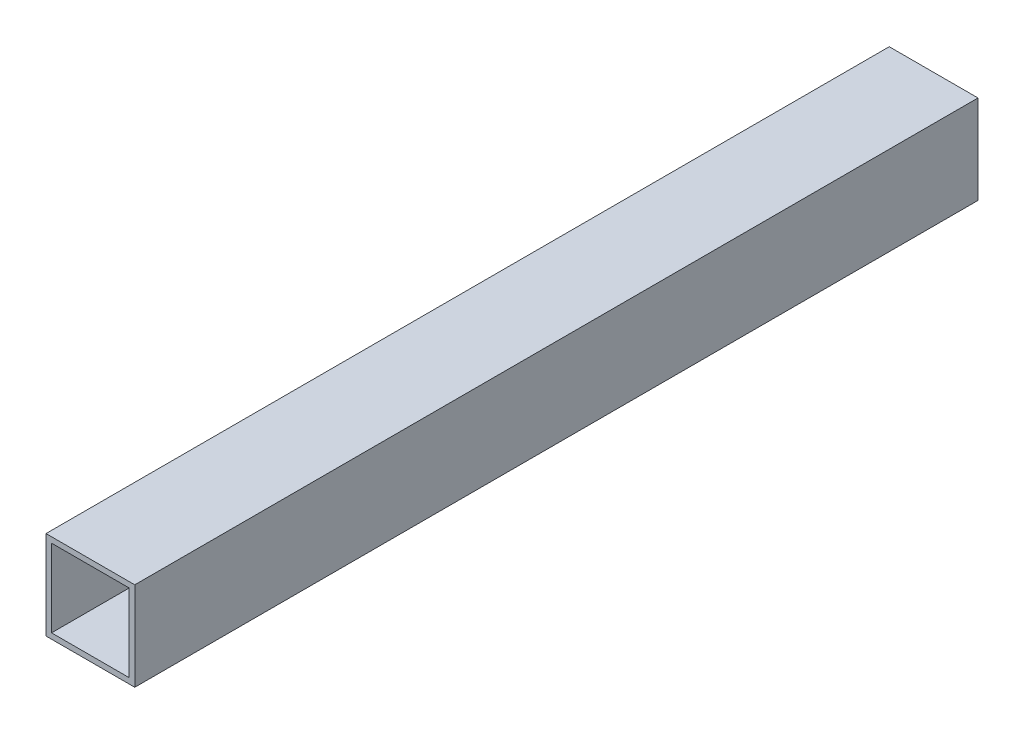
ISO-10303-21;
HEADER;
FILE_DESCRIPTION(('STEP AP214'),'2;1');
FILE_NAME('part.step','',(''),(''),'','','');
FILE_SCHEMA(('AUTOMOTIVE_DESIGN { 1 0 10303 214 1 1 1 1 }'));
ENDSEC;
DATA;
#1=APPLICATION_CONTEXT('core data for automotive mechanical design processes');
#2=APPLICATION_PROTOCOL_DEFINITION('international standard','automotive_design',2000,#1);
#3=PRODUCT_CONTEXT('',#1,'mechanical');
#4=PRODUCT('Part','Part','',(#3));
#5=PRODUCT_RELATED_PRODUCT_CATEGORY('part','',(#4));
#6=PRODUCT_DEFINITION_FORMATION('','',#4);
#7=PRODUCT_DEFINITION_CONTEXT('part definition',#1,'design');
#8=PRODUCT_DEFINITION('design','',#6,#7);
#9=PRODUCT_DEFINITION_SHAPE('','',#8);
#10=(LENGTH_UNIT() NAMED_UNIT(*) SI_UNIT(.MILLI.,.METRE.));
#11=(NAMED_UNIT(*) PLANE_ANGLE_UNIT() SI_UNIT($,.RADIAN.));
#12=(NAMED_UNIT(*) SI_UNIT($,.STERADIAN.) SOLID_ANGLE_UNIT());
#13=UNCERTAINTY_MEASURE_WITH_UNIT(LENGTH_MEASURE(1.E-05),#10,'distance_accuracy_value','');
#14=(GEOMETRIC_REPRESENTATION_CONTEXT(3) GLOBAL_UNCERTAINTY_ASSIGNED_CONTEXT((#13)) GLOBAL_UNIT_ASSIGNED_CONTEXT((#10,
#11,#12)) REPRESENTATION_CONTEXT('',''));
#15=CARTESIAN_POINT('',(0.,0.,0.));
#16=DIRECTION('',(0.,0.,1.));
#17=DIRECTION('',(1.,0.,0.));
#18=AXIS2_PLACEMENT_3D('',#15,#16,#17);
#19=CARTESIAN_POINT('',(0.,0.,482.6));
#20=DIRECTION('',(0.,0.,-1.));
#21=DIRECTION('',(-1.,0.,0.));
#22=AXIS2_PLACEMENT_3D('',#19,#20,#21);
#23=PLANE('',#22);
#24=DIRECTION('',(0.,-1.,0.));
#25=VECTOR('',#24,1.);
#26=CARTESIAN_POINT('',(0.,0.,482.6));
#27=LINE('',#26,#25);
#28=CARTESIAN_POINT('',(0.,50.8,482.6));
#29=VERTEX_POINT('',#28);
#30=CARTESIAN_POINT('',(0.,0.,482.6));
#31=VERTEX_POINT('',#30);
#32=EDGE_CURVE('E134',#29,#31,#27,.T.);
#33=ORIENTED_EDGE('',*,*,#32,.T.);
#34=DIRECTION('',(1.,0.,0.));
#35=VECTOR('',#34,1.);
#36=CARTESIAN_POINT('',(0.,0.,482.6));
#37=LINE('',#36,#35);
#38=CARTESIAN_POINT('',(50.8,0.,482.6));
#39=VERTEX_POINT('',#38);
#40=EDGE_CURVE('E137',#31,#39,#37,.T.);
#41=ORIENTED_EDGE('',*,*,#40,.T.);
#42=DIRECTION('',(0.,1.,0.));
#43=VECTOR('',#42,1.);
#44=CARTESIAN_POINT('',(50.8,0.,482.6));
#45=LINE('',#44,#43);
#46=CARTESIAN_POINT('',(50.8,50.8,482.6));
#47=VERTEX_POINT('',#46);
#48=EDGE_CURVE('E140',#39,#47,#45,.T.);
#49=ORIENTED_EDGE('',*,*,#48,.T.);
#50=DIRECTION('',(-1.,0.,0.));
#51=VECTOR('',#50,1.);
#52=CARTESIAN_POINT('',(0.,50.8,482.6));
#53=LINE('',#52,#51);
#54=EDGE_CURVE('E142',#47,#29,#53,.T.);
#55=ORIENTED_EDGE('',*,*,#54,.T.);
#56=EDGE_LOOP('',(#33,#41,#49,#55));
#57=FACE_BOUND('',#56,.T.);
#58=DIRECTION('',(0.,-1.,0.));
#59=VECTOR('',#58,1.);
#60=CARTESIAN_POINT('',(3.175,47.625,482.6));
#61=LINE('',#60,#59);
#62=CARTESIAN_POINT('',(3.175,47.625,482.6));
#63=VERTEX_POINT('',#62);
#64=CARTESIAN_POINT('',(3.17500000000001,3.175,482.6));
#65=VERTEX_POINT('',#64);
#66=EDGE_CURVE('E98',#63,#65,#61,.T.);
#67=ORIENTED_EDGE('',*,*,#66,.F.);
#68=DIRECTION('',(-1.,0.,0.));
#69=VECTOR('',#68,1.);
#70=CARTESIAN_POINT('',(3.175,47.625,482.6));
#71=LINE('',#70,#69);
#72=CARTESIAN_POINT('',(47.625,47.625,482.6));
#73=VERTEX_POINT('',#72);
#74=EDGE_CURVE('E120',#73,#63,#71,.T.);
#75=ORIENTED_EDGE('',*,*,#74,.F.);
#76=DIRECTION('',(0.,1.,0.));
#77=VECTOR('',#76,1.);
#78=CARTESIAN_POINT('',(47.625,47.625,482.6));
#79=LINE('',#78,#77);
#80=CARTESIAN_POINT('',(47.625,3.175,482.6));
#81=VERTEX_POINT('',#80);
#82=EDGE_CURVE('E118',#81,#73,#79,.T.);
#83=ORIENTED_EDGE('',*,*,#82,.F.);
#84=DIRECTION('',(1.,0.,0.));
#85=VECTOR('',#84,1.);
#86=CARTESIAN_POINT('',(3.17500000000001,3.175,482.6));
#87=LINE('',#86,#85);
#88=EDGE_CURVE('E106',#65,#81,#87,.T.);
#89=ORIENTED_EDGE('',*,*,#88,.F.);
#90=EDGE_LOOP('',(#67,#75,#83,#89));
#91=FACE_BOUND('',#90,.T.);
#92=ADVANCED_FACE('F33',(#57,#91),#23,.F.);
#93=CARTESIAN_POINT('',(0.,0.,0.));
#94=DIRECTION('',(0.,0.,-1.));
#95=DIRECTION('',(-1.,0.,0.));
#96=AXIS2_PLACEMENT_3D('',#93,#94,#95);
#97=PLANE('',#96);
#98=DIRECTION('',(0.,-1.,0.));
#99=VECTOR('',#98,1.);
#100=CARTESIAN_POINT('',(0.,0.,0.));
#101=LINE('',#100,#99);
#102=CARTESIAN_POINT('',(0.,50.8,0.));
#103=VERTEX_POINT('',#102);
#104=CARTESIAN_POINT('',(0.,0.,0.));
#105=VERTEX_POINT('',#104);
#106=EDGE_CURVE('E114',#103,#105,#101,.T.);
#107=ORIENTED_EDGE('',*,*,#106,.F.);
#108=DIRECTION('',(-1.,0.,0.));
#109=VECTOR('',#108,1.);
#110=CARTESIAN_POINT('',(0.,50.8,0.));
#111=LINE('',#110,#109);
#112=CARTESIAN_POINT('',(50.8,50.8,0.));
#113=VERTEX_POINT('',#112);
#114=EDGE_CURVE('E138',#113,#103,#111,.T.);
#115=ORIENTED_EDGE('',*,*,#114,.F.);
#116=DIRECTION('',(0.,1.,0.));
#117=VECTOR('',#116,1.);
#118=CARTESIAN_POINT('',(50.8,0.,0.));
#119=LINE('',#118,#117);
#120=CARTESIAN_POINT('',(50.8,0.,0.));
#121=VERTEX_POINT('',#120);
#122=EDGE_CURVE('E149',#121,#113,#119,.T.);
#123=ORIENTED_EDGE('',*,*,#122,.F.);
#124=DIRECTION('',(1.,0.,0.));
#125=VECTOR('',#124,1.);
#126=CARTESIAN_POINT('',(0.,0.,0.));
#127=LINE('',#126,#125);
#128=EDGE_CURVE('E147',#105,#121,#127,.T.);
#129=ORIENTED_EDGE('',*,*,#128,.F.);
#130=EDGE_LOOP('',(#107,#115,#123,#129));
#131=FACE_BOUND('',#130,.T.);
#132=DIRECTION('',(-1.,0.,0.));
#133=VECTOR('',#132,1.);
#134=CARTESIAN_POINT('',(3.175,47.625,0.));
#135=LINE('',#134,#133);
#136=CARTESIAN_POINT('',(47.625,47.625,0.));
#137=VERTEX_POINT('',#136);
#138=CARTESIAN_POINT('',(3.175,47.625,0.));
#139=VERTEX_POINT('',#138);
#140=EDGE_CURVE('E107',#137,#139,#135,.T.);
#141=ORIENTED_EDGE('',*,*,#140,.T.);
#142=DIRECTION('',(0.,-1.,0.));
#143=VECTOR('',#142,1.);
#144=CARTESIAN_POINT('',(3.175,47.625,0.));
#145=LINE('',#144,#143);
#146=CARTESIAN_POINT('',(3.17500000000001,3.175,0.));
#147=VERTEX_POINT('',#146);
#148=EDGE_CURVE('E56',#139,#147,#145,.T.);
#149=ORIENTED_EDGE('',*,*,#148,.T.);
#150=DIRECTION('',(1.,0.,0.));
#151=VECTOR('',#150,1.);
#152=CARTESIAN_POINT('',(3.17500000000001,3.175,0.));
#153=LINE('',#152,#151);
#154=CARTESIAN_POINT('',(47.625,3.175,0.));
#155=VERTEX_POINT('',#154);
#156=EDGE_CURVE('E113',#147,#155,#153,.T.);
#157=ORIENTED_EDGE('',*,*,#156,.T.);
#158=DIRECTION('',(0.,1.,0.));
#159=VECTOR('',#158,1.);
#160=CARTESIAN_POINT('',(47.625,47.625,0.));
#161=LINE('',#160,#159);
#162=EDGE_CURVE('E126',#155,#137,#161,.T.);
#163=ORIENTED_EDGE('',*,*,#162,.T.);
#164=EDGE_LOOP('',(#141,#149,#157,#163));
#165=FACE_BOUND('',#164,.T.);
#166=ADVANCED_FACE('F167',(#131,#165),#97,.T.);
#167=CARTESIAN_POINT('',(0.,0.,482.6));
#168=DIRECTION('',(1.,0.,0.));
#169=DIRECTION('',(0.,0.,-1.));
#170=AXIS2_PLACEMENT_3D('',#167,#168,#169);
#171=PLANE('',#170);
#172=ORIENTED_EDGE('',*,*,#106,.T.);
#173=DIRECTION('',(0.,0.,-1.));
#174=VECTOR('',#173,1.);
#175=CARTESIAN_POINT('',(0.,0.,482.6));
#176=LINE('',#175,#174);
#177=EDGE_CURVE('E11',#31,#105,#176,.T.);
#178=ORIENTED_EDGE('',*,*,#177,.F.);
#179=ORIENTED_EDGE('',*,*,#32,.F.);
#180=DIRECTION('',(0.,0.,-1.));
#181=VECTOR('',#180,1.);
#182=CARTESIAN_POINT('',(0.,50.8,482.6));
#183=LINE('',#182,#181);
#184=EDGE_CURVE('E144',#29,#103,#183,.T.);
#185=ORIENTED_EDGE('',*,*,#184,.T.);
#186=EDGE_LOOP('',(#172,#178,#179,#185));
#187=FACE_BOUND('',#186,.T.);
#188=ADVANCED_FACE('F35',(#187),#171,.F.);
#189=CARTESIAN_POINT('',(0.,0.,482.6));
#190=DIRECTION('',(0.,1.,0.));
#191=DIRECTION('',(0.,0.,1.));
#192=AXIS2_PLACEMENT_3D('',#189,#190,#191);
#193=PLANE('',#192);
#194=ORIENTED_EDGE('',*,*,#128,.T.);
#195=DIRECTION('',(0.,0.,-1.));
#196=VECTOR('',#195,1.);
#197=CARTESIAN_POINT('',(50.8,0.,482.6));
#198=LINE('',#197,#196);
#199=EDGE_CURVE('E41',#39,#121,#198,.T.);
#200=ORIENTED_EDGE('',*,*,#199,.F.);
#201=ORIENTED_EDGE('',*,*,#40,.F.);
#202=ORIENTED_EDGE('',*,*,#177,.T.);
#203=EDGE_LOOP('',(#194,#200,#201,#202));
#204=FACE_BOUND('',#203,.T.);
#205=ADVANCED_FACE('F177',(#204),#193,.F.);
#206=CARTESIAN_POINT('',(50.8,0.,482.6));
#207=DIRECTION('',(-1.,0.,0.));
#208=DIRECTION('',(0.,0.,1.));
#209=AXIS2_PLACEMENT_3D('',#206,#207,#208);
#210=PLANE('',#209);
#211=ORIENTED_EDGE('',*,*,#122,.T.);
#212=DIRECTION('',(0.,0.,-1.));
#213=VECTOR('',#212,1.);
#214=CARTESIAN_POINT('',(50.8,50.8,482.6));
#215=LINE('',#214,#213);
#216=EDGE_CURVE('E154',#47,#113,#215,.T.);
#217=ORIENTED_EDGE('',*,*,#216,.F.);
#218=ORIENTED_EDGE('',*,*,#48,.F.);
#219=ORIENTED_EDGE('',*,*,#199,.T.);
#220=EDGE_LOOP('',(#211,#217,#218,#219));
#221=FACE_BOUND('',#220,.T.);
#222=ADVANCED_FACE('F161',(#221),#210,.F.);
#223=CARTESIAN_POINT('',(0.,50.8,482.6));
#224=DIRECTION('',(0.,-1.,0.));
#225=DIRECTION('',(0.,0.,-1.));
#226=AXIS2_PLACEMENT_3D('',#223,#224,#225);
#227=PLANE('',#226);
#228=ORIENTED_EDGE('',*,*,#114,.T.);
#229=ORIENTED_EDGE('',*,*,#184,.F.);
#230=ORIENTED_EDGE('',*,*,#54,.F.);
#231=ORIENTED_EDGE('',*,*,#216,.T.);
#232=EDGE_LOOP('',(#228,#229,#230,#231));
#233=FACE_BOUND('',#232,.T.);
#234=ADVANCED_FACE('F171',(#233),#227,.F.);
#235=CARTESIAN_POINT('',(3.175,47.625,482.6));
#236=DIRECTION('',(1.,0.,0.));
#237=DIRECTION('',(0.,1.,0.));
#238=AXIS2_PLACEMENT_3D('',#235,#236,#237);
#239=PLANE('',#238);
#240=ORIENTED_EDGE('',*,*,#148,.F.);
#241=DIRECTION('',(0.,0.,-1.));
#242=VECTOR('',#241,1.);
#243=CARTESIAN_POINT('',(3.175,47.625,482.6));
#244=LINE('',#243,#242);
#245=EDGE_CURVE('E102',#63,#139,#244,.T.);
#246=ORIENTED_EDGE('',*,*,#245,.F.);
#247=ORIENTED_EDGE('',*,*,#66,.T.);
#248=DIRECTION('',(0.,0.,-1.));
#249=VECTOR('',#248,1.);
#250=CARTESIAN_POINT('',(3.17500000000001,3.175,482.6));
#251=LINE('',#250,#249);
#252=EDGE_CURVE('E101',#65,#147,#251,.T.);
#253=ORIENTED_EDGE('',*,*,#252,.T.);
#254=EDGE_LOOP('',(#240,#246,#247,#253));
#255=FACE_BOUND('',#254,.T.);
#256=ADVANCED_FACE('F100',(#255),#239,.T.);
#257=CARTESIAN_POINT('',(3.17500000000001,3.175,482.6));
#258=DIRECTION('',(0.,1.,0.));
#259=DIRECTION('',(0.,0.,1.));
#260=AXIS2_PLACEMENT_3D('',#257,#258,#259);
#261=PLANE('',#260);
#262=ORIENTED_EDGE('',*,*,#156,.F.);
#263=ORIENTED_EDGE('',*,*,#252,.F.);
#264=ORIENTED_EDGE('',*,*,#88,.T.);
#265=DIRECTION('',(0.,0.,-1.));
#266=VECTOR('',#265,1.);
#267=CARTESIAN_POINT('',(47.625,3.175,482.6));
#268=LINE('',#267,#266);
#269=EDGE_CURVE('E115',#81,#155,#268,.T.);
#270=ORIENTED_EDGE('',*,*,#269,.T.);
#271=EDGE_LOOP('',(#262,#263,#264,#270));
#272=FACE_BOUND('',#271,.T.);
#273=ADVANCED_FACE('F110',(#272),#261,.T.);
#274=CARTESIAN_POINT('',(47.625,47.625,482.6));
#275=DIRECTION('',(-1.,0.,0.));
#276=DIRECTION('',(0.,-1.,0.));
#277=AXIS2_PLACEMENT_3D('',#274,#275,#276);
#278=PLANE('',#277);
#279=ORIENTED_EDGE('',*,*,#162,.F.);
#280=ORIENTED_EDGE('',*,*,#269,.F.);
#281=ORIENTED_EDGE('',*,*,#82,.T.);
#282=DIRECTION('',(0.,0.,-1.));
#283=VECTOR('',#282,1.);
#284=CARTESIAN_POINT('',(47.625,47.625,482.6));
#285=LINE('',#284,#283);
#286=EDGE_CURVE('E48',#73,#137,#285,.T.);
#287=ORIENTED_EDGE('',*,*,#286,.T.);
#288=EDGE_LOOP('',(#279,#280,#281,#287));
#289=FACE_BOUND('',#288,.T.);
#290=ADVANCED_FACE('F200',(#289),#278,.T.);
#291=CARTESIAN_POINT('',(3.175,47.625,482.6));
#292=DIRECTION('',(0.,-1.,0.));
#293=DIRECTION('',(0.,0.,-1.));
#294=AXIS2_PLACEMENT_3D('',#291,#292,#293);
#295=PLANE('',#294);
#296=ORIENTED_EDGE('',*,*,#140,.F.);
#297=ORIENTED_EDGE('',*,*,#286,.F.);
#298=ORIENTED_EDGE('',*,*,#74,.T.);
#299=ORIENTED_EDGE('',*,*,#245,.T.);
#300=EDGE_LOOP('',(#296,#297,#298,#299));
#301=FACE_BOUND('',#300,.T.);
#302=ADVANCED_FACE('F204',(#301),#295,.T.);
#303=CLOSED_SHELL('',(#92,#166,#188,#205,#222,#234,#256,#273,#290,#302));
#304=MANIFOLD_SOLID_BREP('B2',#303);
#305=ADVANCED_BREP_SHAPE_REPRESENTATION('',(#18,#304),#14);
#306=SHAPE_DEFINITION_REPRESENTATION(#9,#305);
ENDSEC;
END-ISO-10303-21;
